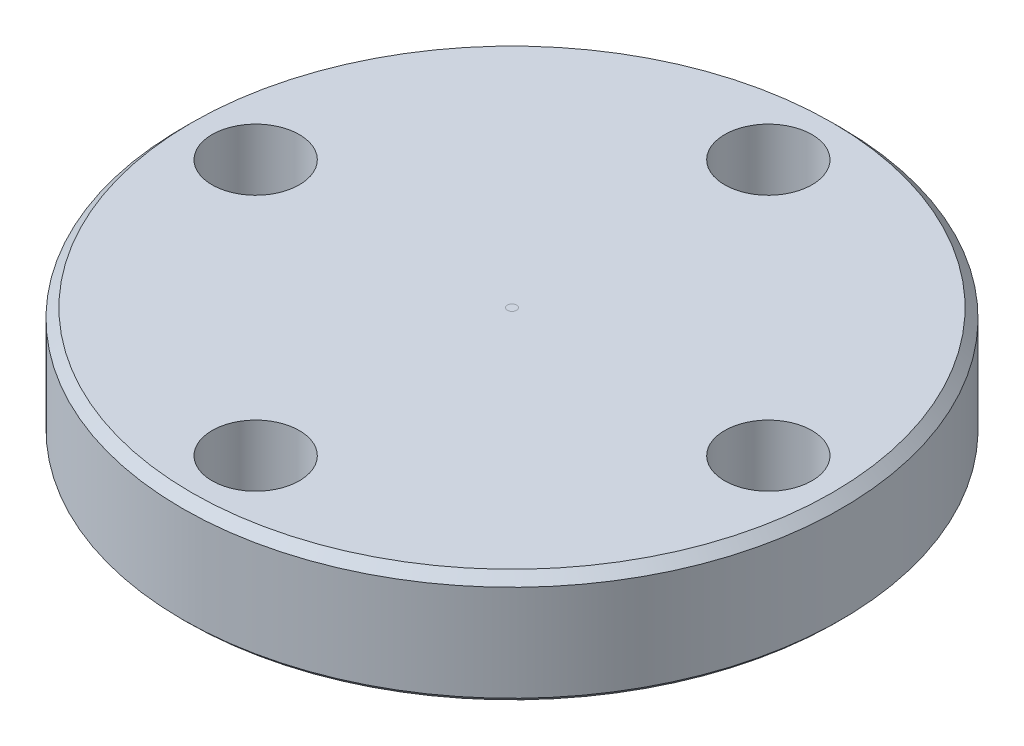
ISO-10303-21;
HEADER;
FILE_DESCRIPTION(('STEP AP214'),'2;1');
FILE_NAME('part.step','',(''),(''),'','','');
FILE_SCHEMA(('AUTOMOTIVE_DESIGN { 1 0 10303 214 1 1 1 1 }'));
ENDSEC;
DATA;
#1=APPLICATION_CONTEXT('core data for automotive mechanical design processes');
#2=APPLICATION_PROTOCOL_DEFINITION('international standard','automotive_design',2000,#1);
#3=PRODUCT_CONTEXT('',#1,'mechanical');
#4=PRODUCT('Part','Part','',(#3));
#5=PRODUCT_RELATED_PRODUCT_CATEGORY('part','',(#4));
#6=PRODUCT_DEFINITION_FORMATION('','',#4);
#7=PRODUCT_DEFINITION_CONTEXT('part definition',#1,'design');
#8=PRODUCT_DEFINITION('design','',#6,#7);
#9=PRODUCT_DEFINITION_SHAPE('','',#8);
#10=(LENGTH_UNIT() NAMED_UNIT(*) SI_UNIT(.MILLI.,.METRE.));
#11=(NAMED_UNIT(*) PLANE_ANGLE_UNIT() SI_UNIT($,.RADIAN.));
#12=(NAMED_UNIT(*) SI_UNIT($,.STERADIAN.) SOLID_ANGLE_UNIT());
#13=UNCERTAINTY_MEASURE_WITH_UNIT(LENGTH_MEASURE(1.E-05),#10,'distance_accuracy_value','');
#14=(GEOMETRIC_REPRESENTATION_CONTEXT(3) GLOBAL_UNCERTAINTY_ASSIGNED_CONTEXT((#13)) GLOBAL_UNIT_ASSIGNED_CONTEXT((#10,
#11,#12)) REPRESENTATION_CONTEXT('',''));
#15=CARTESIAN_POINT('',(0.,0.,0.));
#16=DIRECTION('',(0.,0.,1.));
#17=DIRECTION('',(1.,0.,0.));
#18=AXIS2_PLACEMENT_3D('',#15,#16,#17);
#19=CARTESIAN_POINT('',(0.,12.,0.));
#20=DIRECTION('',(0.,-1.,0.));
#21=DIRECTION('',(0.,0.,-1.));
#22=AXIS2_PLACEMENT_3D('',#19,#20,#21);
#23=CYLINDRICAL_SURFACE('',#22,0.499735391729039);
#24=CARTESIAN_POINT('',(0.,12.,0.));
#25=DIRECTION('',(0.,1.,0.));
#26=DIRECTION('',(0.,0.,1.));
#27=AXIS2_PLACEMENT_3D('',#24,#25,#26);
#28=CIRCLE('',#27,0.499735391729039);
#29=CARTESIAN_POINT('',(0.,12.,0.499735391729039));
#30=VERTEX_POINT('',#29);
#31=EDGE_CURVE('E11',#30,#30,#28,.T.);
#32=ORIENTED_EDGE('',*,*,#31,.F.);
#33=EDGE_LOOP('',(#32));
#34=FACE_BOUND('',#33,.T.);
#35=CARTESIAN_POINT('',(0.,0.,0.));
#36=DIRECTION('',(0.,1.,0.));
#37=DIRECTION('',(0.,0.,1.));
#38=AXIS2_PLACEMENT_3D('',#35,#36,#37);
#39=CIRCLE('',#38,0.499735391729039);
#40=CARTESIAN_POINT('',(0.,0.,0.499735391729039));
#41=VERTEX_POINT('',#40);
#42=EDGE_CURVE('E45',#41,#41,#39,.T.);
#43=ORIENTED_EDGE('',*,*,#42,.T.);
#44=EDGE_LOOP('',(#43));
#45=FACE_BOUND('',#44,.T.);
#46=ADVANCED_FACE('F42',(#34,#45),#23,.T.);
#47=CARTESIAN_POINT('',(0.,12.,0.));
#48=DIRECTION('',(0.,1.,0.));
#49=DIRECTION('',(0.,0.,1.));
#50=AXIS2_PLACEMENT_3D('',#47,#48,#49);
#51=PLANE('',#50);
#52=ORIENTED_EDGE('',*,*,#31,.T.);
#53=EDGE_LOOP('',(#52));
#54=FACE_BOUND('',#53,.T.);
#55=ADVANCED_FACE('F57',(#54),#51,.T.);
#56=CARTESIAN_POINT('',(0.,0.,0.));
#57=DIRECTION('',(0.,1.,0.));
#58=DIRECTION('',(0.,0.,1.));
#59=AXIS2_PLACEMENT_3D('',#56,#57,#58);
#60=PLANE('',#59);
#61=ORIENTED_EDGE('',*,*,#42,.F.);
#62=EDGE_LOOP('',(#61));
#63=FACE_BOUND('',#62,.T.);
#64=ADVANCED_FACE('F55',(#63),#60,.F.);
#65=CLOSED_SHELL('',(#46,#55,#64));
#66=MANIFOLD_SOLID_BREP('B2',#65);
#67=CARTESIAN_POINT('',(0.,12.,0.));
#68=DIRECTION('',(0.,1.,0.));
#69=DIRECTION('',(0.,0.,1.));
#70=AXIS2_PLACEMENT_3D('',#67,#68,#69);
#71=PLANE('',#70);
#72=CARTESIAN_POINT('',(0.,12.,0.));
#73=DIRECTION('',(0.,1.,0.));
#74=DIRECTION('',(0.,0.,1.));
#75=AXIS2_PLACEMENT_3D('',#72,#73,#74);
#76=CIRCLE('',#75,35.);
#77=CARTESIAN_POINT('',(0.,12.,35.));
#78=VERTEX_POINT('',#77);
#79=EDGE_CURVE('E98',#78,#78,#76,.T.);
#80=ORIENTED_EDGE('',*,*,#79,.T.);
#81=EDGE_LOOP('',(#80));
#82=FACE_BOUND('',#81,.T.);
#83=CARTESIAN_POINT('',(28.,12.,0.));
#84=DIRECTION('',(0.,1.,0.));
#85=DIRECTION('',(1.,0.,0.));
#86=AXIS2_PLACEMENT_3D('',#83,#84,#85);
#87=CIRCLE('',#86,4.765);
#88=CARTESIAN_POINT('',(32.765,12.,-1.14398386067195E-13));
#89=VERTEX_POINT('',#88);
#90=EDGE_CURVE('E128',#89,#89,#87,.T.);
#91=ORIENTED_EDGE('',*,*,#90,.F.);
#92=EDGE_LOOP('',(#91));
#93=FACE_BOUND('',#92,.T.);
#94=CARTESIAN_POINT('',(0.,12.,-28.));
#95=DIRECTION('',(0.,1.,0.));
#96=DIRECTION('',(0.,0.,-1.));
#97=AXIS2_PLACEMENT_3D('',#94,#95,#96);
#98=CIRCLE('',#97,4.765);
#99=CARTESIAN_POINT('',(0.,12.,-32.765));
#100=VERTEX_POINT('',#99);
#101=EDGE_CURVE('E122',#100,#100,#98,.T.);
#102=ORIENTED_EDGE('',*,*,#101,.F.);
#103=EDGE_LOOP('',(#102));
#104=FACE_BOUND('',#103,.T.);
#105=CARTESIAN_POINT('',(-28.,12.,2.93284432462823E-13));
#106=DIRECTION('',(0.,1.,0.));
#107=DIRECTION('',(-1.,0.,0.));
#108=AXIS2_PLACEMENT_3D('',#105,#106,#107);
#109=CIRCLE('',#108,4.765);
#110=CARTESIAN_POINT('',(-32.765,12.,3.43195158201586E-13));
#111=VERTEX_POINT('',#110);
#112=EDGE_CURVE('E116',#111,#111,#109,.T.);
#113=ORIENTED_EDGE('',*,*,#112,.F.);
#114=EDGE_LOOP('',(#113));
#115=FACE_BOUND('',#114,.T.);
#116=CARTESIAN_POINT('',(0.,12.,28.));
#117=DIRECTION('',(0.,1.,0.));
#118=DIRECTION('',(0.,0.,1.));
#119=AXIS2_PLACEMENT_3D('',#116,#117,#118);
#120=CIRCLE('',#119,4.765);
#121=CARTESIAN_POINT('',(0.,12.,32.765));
#122=VERTEX_POINT('',#121);
#123=EDGE_CURVE('E110',#122,#122,#120,.T.);
#124=ORIENTED_EDGE('',*,*,#123,.F.);
#125=EDGE_LOOP('',(#124));
#126=FACE_BOUND('',#125,.T.);
#127=CARTESIAN_POINT('',(0.,12.,0.));
#128=DIRECTION('',(0.,1.,0.));
#129=DIRECTION('',(0.,0.,1.));
#130=AXIS2_PLACEMENT_3D('',#127,#128,#129);
#131=CIRCLE('',#130,0.5);
#132=CARTESIAN_POINT('',(0.,12.,0.5));
#133=VERTEX_POINT('',#132);
#134=EDGE_CURVE('E103',#133,#133,#131,.T.);
#135=ORIENTED_EDGE('',*,*,#134,.F.);
#136=EDGE_LOOP('',(#135));
#137=FACE_BOUND('',#136,.T.);
#138=ADVANCED_FACE('F82',(#82,#93,#104,#115,#126,#137),#71,.T.);
#139=CARTESIAN_POINT('',(0.,0.,0.));
#140=DIRECTION('',(0.,1.,0.));
#141=DIRECTION('',(0.,0.,1.));
#142=AXIS2_PLACEMENT_3D('',#139,#140,#141);
#143=PLANE('',#142);
#144=CARTESIAN_POINT('',(0.,0.,0.));
#145=DIRECTION('',(0.,1.,0.));
#146=DIRECTION('',(0.,0.,1.));
#147=AXIS2_PLACEMENT_3D('',#144,#145,#146);
#148=CIRCLE('',#147,35.5);
#149=CARTESIAN_POINT('',(0.,0.,35.5));
#150=VERTEX_POINT('',#149);
#151=EDGE_CURVE('E41',#150,#150,#148,.F.);
#152=ORIENTED_EDGE('',*,*,#151,.T.);
#153=EDGE_LOOP('',(#152));
#154=FACE_BOUND('',#153,.T.);
#155=CARTESIAN_POINT('',(28.,0.,0.));
#156=DIRECTION('',(0.,1.,0.));
#157=DIRECTION('',(1.,0.,0.));
#158=AXIS2_PLACEMENT_3D('',#155,#156,#157);
#159=CIRCLE('',#158,4.765);
#160=CARTESIAN_POINT('',(32.765,0.,-1.14398386067195E-13));
#161=VERTEX_POINT('',#160);
#162=EDGE_CURVE('E113',#161,#161,#159,.T.);
#163=ORIENTED_EDGE('',*,*,#162,.T.);
#164=EDGE_LOOP('',(#163));
#165=FACE_BOUND('',#164,.T.);
#166=CARTESIAN_POINT('',(0.,0.,-28.));
#167=DIRECTION('',(0.,1.,0.));
#168=DIRECTION('',(0.,0.,-1.));
#169=AXIS2_PLACEMENT_3D('',#166,#167,#168);
#170=CIRCLE('',#169,4.765);
#171=CARTESIAN_POINT('',(0.,0.,-32.765));
#172=VERTEX_POINT('',#171);
#173=EDGE_CURVE('E125',#172,#172,#170,.T.);
#174=ORIENTED_EDGE('',*,*,#173,.T.);
#175=EDGE_LOOP('',(#174));
#176=FACE_BOUND('',#175,.T.);
#177=CARTESIAN_POINT('',(-28.,0.,2.93284432462823E-13));
#178=DIRECTION('',(0.,1.,0.));
#179=DIRECTION('',(-1.,0.,0.));
#180=AXIS2_PLACEMENT_3D('',#177,#178,#179);
#181=CIRCLE('',#180,4.765);
#182=CARTESIAN_POINT('',(-32.765,0.,3.43195158201586E-13));
#183=VERTEX_POINT('',#182);
#184=EDGE_CURVE('E119',#183,#183,#181,.T.);
#185=ORIENTED_EDGE('',*,*,#184,.T.);
#186=EDGE_LOOP('',(#185));
#187=FACE_BOUND('',#186,.T.);
#188=CARTESIAN_POINT('',(0.,0.,28.));
#189=DIRECTION('',(0.,1.,0.));
#190=DIRECTION('',(0.,0.,1.));
#191=AXIS2_PLACEMENT_3D('',#188,#189,#190);
#192=CIRCLE('',#191,4.765);
#193=CARTESIAN_POINT('',(0.,0.,32.765));
#194=VERTEX_POINT('',#193);
#195=EDGE_CURVE('E107',#194,#194,#192,.T.);
#196=ORIENTED_EDGE('',*,*,#195,.T.);
#197=EDGE_LOOP('',(#196));
#198=FACE_BOUND('',#197,.T.);
#199=CARTESIAN_POINT('',(0.,0.,0.));
#200=DIRECTION('',(0.,1.,0.));
#201=DIRECTION('',(0.,0.,1.));
#202=AXIS2_PLACEMENT_3D('',#199,#200,#201);
#203=CIRCLE('',#202,0.5);
#204=CARTESIAN_POINT('',(0.,0.,0.5));
#205=VERTEX_POINT('',#204);
#206=EDGE_CURVE('E104',#205,#205,#203,.T.);
#207=ORIENTED_EDGE('',*,*,#206,.T.);
#208=EDGE_LOOP('',(#207));
#209=FACE_BOUND('',#208,.T.);
#210=ADVANCED_FACE('F134',(#154,#165,#176,#187,#198,#209),#143,.F.);
#211=CARTESIAN_POINT('',(0.,12.,0.));
#212=DIRECTION('',(0.,-1.,0.));
#213=DIRECTION('',(0.,0.,-1.));
#214=AXIS2_PLACEMENT_3D('',#211,#212,#213);
#215=CYLINDRICAL_SURFACE('',#214,36.);
#216=CARTESIAN_POINT('',(0.,0.499999999999994,0.));
#217=DIRECTION('',(0.,1.,0.));
#218=DIRECTION('',(0.,0.,1.));
#219=AXIS2_PLACEMENT_3D('',#216,#217,#218);
#220=CIRCLE('',#219,36.);
#221=CARTESIAN_POINT('',(0.,0.499999999999994,36.));
#222=VERTEX_POINT('',#221);
#223=EDGE_CURVE('E90',#222,#222,#220,.T.);
#224=ORIENTED_EDGE('',*,*,#223,.T.);
#225=EDGE_LOOP('',(#224));
#226=FACE_BOUND('',#225,.T.);
#227=CARTESIAN_POINT('',(0.,11.,0.));
#228=DIRECTION('',(0.,1.,0.));
#229=DIRECTION('',(0.,0.,1.));
#230=AXIS2_PLACEMENT_3D('',#227,#228,#229);
#231=CIRCLE('',#230,36.);
#232=CARTESIAN_POINT('',(0.,11.,36.));
#233=VERTEX_POINT('',#232);
#234=EDGE_CURVE('E94',#233,#233,#231,.F.);
#235=ORIENTED_EDGE('',*,*,#234,.T.);
#236=EDGE_LOOP('',(#235));
#237=FACE_BOUND('',#236,.T.);
#238=ADVANCED_FACE('F161',(#226,#237),#215,.T.);
#239=CARTESIAN_POINT('',(0.,12.,0.));
#240=DIRECTION('',(0.,-1.,0.));
#241=DIRECTION('',(0.,0.,-1.));
#242=AXIS2_PLACEMENT_3D('',#239,#240,#241);
#243=CYLINDRICAL_SURFACE('',#242,0.5);
#244=ORIENTED_EDGE('',*,*,#134,.T.);
#245=EDGE_LOOP('',(#244));
#246=FACE_BOUND('',#245,.T.);
#247=ORIENTED_EDGE('',*,*,#206,.F.);
#248=EDGE_LOOP('',(#247));
#249=FACE_BOUND('',#248,.T.);
#250=ADVANCED_FACE('F157',(#246,#249),#243,.F.);
#251=CARTESIAN_POINT('',(0.,0.,28.));
#252=DIRECTION('',(0.,1.,0.));
#253=DIRECTION('',(0.,0.,1.));
#254=AXIS2_PLACEMENT_3D('',#251,#252,#253);
#255=CYLINDRICAL_SURFACE('',#254,4.765);
#256=ORIENTED_EDGE('',*,*,#195,.F.);
#257=EDGE_LOOP('',(#256));
#258=FACE_BOUND('',#257,.T.);
#259=ORIENTED_EDGE('',*,*,#123,.T.);
#260=EDGE_LOOP('',(#259));
#261=FACE_BOUND('',#260,.T.);
#262=ADVANCED_FACE('F160',(#258,#261),#255,.F.);
#263=CARTESIAN_POINT('',(-28.,0.,2.93284432462823E-13));
#264=DIRECTION('',(0.,1.,0.));
#265=DIRECTION('',(0.,0.,1.));
#266=AXIS2_PLACEMENT_3D('',#263,#264,#265);
#267=CYLINDRICAL_SURFACE('',#266,4.765);
#268=ORIENTED_EDGE('',*,*,#184,.F.);
#269=EDGE_LOOP('',(#268));
#270=FACE_BOUND('',#269,.T.);
#271=ORIENTED_EDGE('',*,*,#112,.T.);
#272=EDGE_LOOP('',(#271));
#273=FACE_BOUND('',#272,.T.);
#274=ADVANCED_FACE('F223',(#270,#273),#267,.F.);
#275=CARTESIAN_POINT('',(0.,0.,-28.));
#276=DIRECTION('',(0.,1.,0.));
#277=DIRECTION('',(0.,0.,1.));
#278=AXIS2_PLACEMENT_3D('',#275,#276,#277);
#279=CYLINDRICAL_SURFACE('',#278,4.765);
#280=ORIENTED_EDGE('',*,*,#173,.F.);
#281=EDGE_LOOP('',(#280));
#282=FACE_BOUND('',#281,.T.);
#283=ORIENTED_EDGE('',*,*,#101,.T.);
#284=EDGE_LOOP('',(#283));
#285=FACE_BOUND('',#284,.T.);
#286=ADVANCED_FACE('F141',(#282,#285),#279,.F.);
#287=CARTESIAN_POINT('',(28.,0.,0.));
#288=DIRECTION('',(0.,1.,0.));
#289=DIRECTION('',(0.,0.,1.));
#290=AXIS2_PLACEMENT_3D('',#287,#288,#289);
#291=CYLINDRICAL_SURFACE('',#290,4.765);
#292=ORIENTED_EDGE('',*,*,#162,.F.);
#293=EDGE_LOOP('',(#292));
#294=FACE_BOUND('',#293,.T.);
#295=ORIENTED_EDGE('',*,*,#90,.T.);
#296=EDGE_LOOP('',(#295));
#297=FACE_BOUND('',#296,.T.);
#298=ADVANCED_FACE('F137',(#294,#297),#291,.F.);
#299=CARTESIAN_POINT('',(0.,12.,0.));
#300=DIRECTION('',(0.,-1.,0.));
#301=DIRECTION('',(0.,0.,-1.));
#302=AXIS2_PLACEMENT_3D('',#299,#300,#301);
#303=CONICAL_SURFACE('',#302,35.,0.785398163397441);
#304=ORIENTED_EDGE('',*,*,#234,.F.);
#305=EDGE_LOOP('',(#304));
#306=FACE_BOUND('',#305,.T.);
#307=ORIENTED_EDGE('',*,*,#79,.F.);
#308=EDGE_LOOP('',(#307));
#309=FACE_BOUND('',#308,.T.);
#310=ADVANCED_FACE('F140',(#306,#309),#303,.T.);
#311=CARTESIAN_POINT('',(0.,0.499999999999994,0.));
#312=DIRECTION('',(0.,1.,0.));
#313=DIRECTION('',(0.,0.,1.));
#314=AXIS2_PLACEMENT_3D('',#311,#312,#313);
#315=CONICAL_SURFACE('',#314,36.,0.785398163397448);
#316=ORIENTED_EDGE('',*,*,#151,.F.);
#317=EDGE_LOOP('',(#316));
#318=FACE_BOUND('',#317,.T.);
#319=ORIENTED_EDGE('',*,*,#223,.F.);
#320=EDGE_LOOP('',(#319));
#321=FACE_BOUND('',#320,.T.);
#322=ADVANCED_FACE('F85',(#318,#321),#315,.T.);
#323=CLOSED_SHELL('',(#138,#210,#238,#250,#262,#274,#286,#298,#310,#322));
#324=MANIFOLD_SOLID_BREP('B6',#323);
#325=ADVANCED_BREP_SHAPE_REPRESENTATION('',(#18,#66,#324),#14);
#326=SHAPE_DEFINITION_REPRESENTATION(#9,#325);
ENDSEC;
END-ISO-10303-21;
